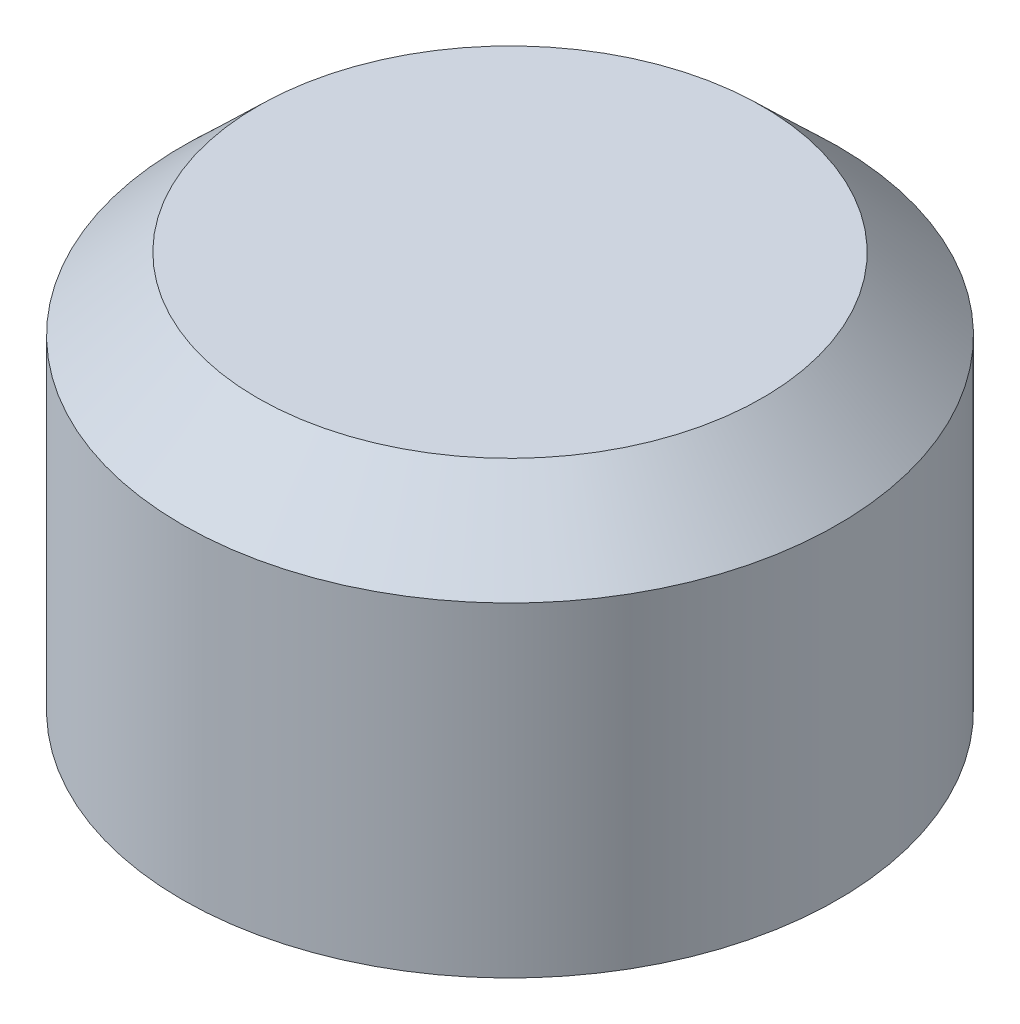
ISO-10303-21;
HEADER;
FILE_DESCRIPTION(('STEP AP214'),'2;1');
FILE_NAME('part.step','',(''),(''),'','','');
FILE_SCHEMA(('AUTOMOTIVE_DESIGN { 1 0 10303 214 1 1 1 1 }'));
ENDSEC;
DATA;
#1=APPLICATION_CONTEXT('core data for automotive mechanical design processes');
#2=APPLICATION_PROTOCOL_DEFINITION('international standard','automotive_design',2000,#1);
#3=PRODUCT_CONTEXT('',#1,'mechanical');
#4=PRODUCT('Part','Part','',(#3));
#5=PRODUCT_RELATED_PRODUCT_CATEGORY('part','',(#4));
#6=PRODUCT_DEFINITION_FORMATION('','',#4);
#7=PRODUCT_DEFINITION_CONTEXT('part definition',#1,'design');
#8=PRODUCT_DEFINITION('design','',#6,#7);
#9=PRODUCT_DEFINITION_SHAPE('','',#8);
#10=(LENGTH_UNIT() NAMED_UNIT(*) SI_UNIT(.MILLI.,.METRE.));
#11=(NAMED_UNIT(*) PLANE_ANGLE_UNIT() SI_UNIT($,.RADIAN.));
#12=(NAMED_UNIT(*) SI_UNIT($,.STERADIAN.) SOLID_ANGLE_UNIT());
#13=UNCERTAINTY_MEASURE_WITH_UNIT(LENGTH_MEASURE(1.E-05),#10,'distance_accuracy_value','');
#14=(GEOMETRIC_REPRESENTATION_CONTEXT(3) GLOBAL_UNCERTAINTY_ASSIGNED_CONTEXT((#13)) GLOBAL_UNIT_ASSIGNED_CONTEXT((#10,
#11,#12)) REPRESENTATION_CONTEXT('',''));
#15=CARTESIAN_POINT('',(0.,0.,0.));
#16=DIRECTION('',(0.,0.,1.));
#17=DIRECTION('',(1.,0.,0.));
#18=AXIS2_PLACEMENT_3D('',#15,#16,#17);
#19=CARTESIAN_POINT('',(0.,3520.44,0.));
#20=DIRECTION('',(0.,1.,0.));
#21=DIRECTION('',(0.,0.,1.));
#22=AXIS2_PLACEMENT_3D('',#19,#20,#21);
#23=CYLINDRICAL_SURFACE('',#22,2743.2);
#24=CARTESIAN_POINT('',(0.,2732.37406594724,0.));
#25=DIRECTION('',(0.,1.,0.));
#26=DIRECTION('',(0.,0.,1.));
#27=AXIS2_PLACEMENT_3D('',#24,#25,#26);
#28=CIRCLE('',#27,2743.2);
#29=CARTESIAN_POINT('',(0.,2732.37406594724,2743.2));
#30=VERTEX_POINT('',#29);
#31=EDGE_CURVE('E64',#30,#30,#28,.T.);
#32=ORIENTED_EDGE('',*,*,#31,.T.);
#33=EDGE_LOOP('',(#32));
#34=FACE_BOUND('',#33,.T.);
#35=CARTESIAN_POINT('',(0.,0.,0.));
#36=DIRECTION('',(0.,1.,0.));
#37=DIRECTION('',(0.,0.,1.));
#38=AXIS2_PLACEMENT_3D('',#35,#36,#37);
#39=CIRCLE('',#38,2743.2);
#40=CARTESIAN_POINT('',(0.,0.,2743.2));
#41=VERTEX_POINT('',#40);
#42=EDGE_CURVE('E11',#41,#41,#39,.T.);
#43=ORIENTED_EDGE('',*,*,#42,.F.);
#44=EDGE_LOOP('',(#43));
#45=FACE_BOUND('',#44,.T.);
#46=ADVANCED_FACE('F42',(#34,#45),#23,.F.);
#47=CARTESIAN_POINT('',(-2743.2,0.,0.));
#48=DIRECTION('',(0.,-1.,0.));
#49=DIRECTION('',(0.,0.,-1.));
#50=AXIS2_PLACEMENT_3D('',#47,#48,#49);
#51=PLANE('',#50);
#52=ORIENTED_EDGE('',*,*,#42,.T.);
#53=EDGE_LOOP('',(#52));
#54=FACE_BOUND('',#53,.T.);
#55=CARTESIAN_POINT('',(0.,0.,0.));
#56=DIRECTION('',(0.,1.,0.));
#57=DIRECTION('',(0.,0.,1.));
#58=AXIS2_PLACEMENT_3D('',#55,#56,#57);
#59=CIRCLE('',#58,2768.6);
#60=CARTESIAN_POINT('',(0.,0.,2768.6));
#61=VERTEX_POINT('',#60);
#62=EDGE_CURVE('E48',#61,#61,#59,.T.);
#63=ORIENTED_EDGE('',*,*,#62,.F.);
#64=EDGE_LOOP('',(#63));
#65=FACE_BOUND('',#64,.T.);
#66=ADVANCED_FACE('F82',(#54,#65),#51,.T.);
#67=CARTESIAN_POINT('',(0.,3520.44,0.));
#68=DIRECTION('',(0.,1.,0.));
#69=DIRECTION('',(0.,0.,1.));
#70=AXIS2_PLACEMENT_3D('',#67,#68,#69);
#71=CYLINDRICAL_SURFACE('',#70,2768.6);
#72=ORIENTED_EDGE('',*,*,#62,.T.);
#73=EDGE_LOOP('',(#72));
#74=FACE_BOUND('',#73,.T.);
#75=CARTESIAN_POINT('',(0.,2743.2,0.));
#76=DIRECTION('',(0.,1.,0.));
#77=DIRECTION('',(0.,0.,1.));
#78=AXIS2_PLACEMENT_3D('',#75,#76,#77);
#79=CIRCLE('',#78,2768.6);
#80=CARTESIAN_POINT('',(0.,2743.2,2768.6));
#81=VERTEX_POINT('',#80);
#82=EDGE_CURVE('E52',#81,#81,#79,.T.);
#83=ORIENTED_EDGE('',*,*,#82,.F.);
#84=EDGE_LOOP('',(#83));
#85=FACE_BOUND('',#84,.T.);
#86=ADVANCED_FACE('F86',(#74,#85),#71,.T.);
#87=CARTESIAN_POINT('',(0.,3352.8,0.));
#88=DIRECTION('',(0.,-1.,0.));
#89=DIRECTION('',(0.,0.,-1.));
#90=AXIS2_PLACEMENT_3D('',#87,#88,#89);
#91=CONICAL_SURFACE('',#90,2133.6,0.805803494083987);
#92=ORIENTED_EDGE('',*,*,#82,.T.);
#93=EDGE_LOOP('',(#92));
#94=FACE_BOUND('',#93,.T.);
#95=CARTESIAN_POINT('',(0.,3352.8,0.));
#96=DIRECTION('',(0.,1.,0.));
#97=DIRECTION('',(0.,0.,1.));
#98=AXIS2_PLACEMENT_3D('',#95,#96,#97);
#99=CIRCLE('',#98,2133.6);
#100=CARTESIAN_POINT('',(0.,3352.8,2133.6));
#101=VERTEX_POINT('',#100);
#102=EDGE_CURVE('E56',#101,#101,#99,.T.);
#103=ORIENTED_EDGE('',*,*,#102,.F.);
#104=EDGE_LOOP('',(#103));
#105=FACE_BOUND('',#104,.T.);
#106=ADVANCED_FACE('F90',(#94,#105),#91,.T.);
#107=CARTESIAN_POINT('',(0.,3352.8,0.));
#108=DIRECTION('',(0.,1.,0.));
#109=DIRECTION('',(0.,0.,1.));
#110=AXIS2_PLACEMENT_3D('',#107,#108,#109);
#111=PLANE('',#110);
#112=ORIENTED_EDGE('',*,*,#102,.T.);
#113=EDGE_LOOP('',(#112));
#114=FACE_BOUND('',#113,.T.);
#115=ADVANCED_FACE('F78',(#114),#111,.T.);
#116=CARTESIAN_POINT('',(-2123.38131869504,3327.4,0.));
#117=DIRECTION('',(0.,-1.,0.));
#118=DIRECTION('',(0.,0.,-1.));
#119=AXIS2_PLACEMENT_3D('',#116,#117,#118);
#120=PLANE('',#119);
#121=CARTESIAN_POINT('',(0.,3327.4,0.));
#122=DIRECTION('',(0.,1.,0.));
#123=DIRECTION('',(0.,0.,1.));
#124=AXIS2_PLACEMENT_3D('',#121,#122,#123);
#125=CIRCLE('',#124,2123.38131869504);
#126=CARTESIAN_POINT('',(0.,3327.4,2123.38131869504));
#127=VERTEX_POINT('',#126);
#128=EDGE_CURVE('E61',#127,#127,#125,.T.);
#129=ORIENTED_EDGE('',*,*,#128,.F.);
#130=EDGE_LOOP('',(#129));
#131=FACE_BOUND('',#130,.T.);
#132=ADVANCED_FACE('F72',(#131),#120,.T.);
#133=CARTESIAN_POINT('',(0.,2732.37406594724,0.));
#134=DIRECTION('',(0.,-1.,0.));
#135=DIRECTION('',(0.,0.,-1.));
#136=AXIS2_PLACEMENT_3D('',#133,#134,#135);
#137=CONICAL_SURFACE('',#136,2743.2,0.805803494083986);
#138=ORIENTED_EDGE('',*,*,#128,.T.);
#139=EDGE_LOOP('',(#138));
#140=FACE_BOUND('',#139,.T.);
#141=ORIENTED_EDGE('',*,*,#31,.F.);
#142=EDGE_LOOP('',(#141));
#143=FACE_BOUND('',#142,.T.);
#144=ADVANCED_FACE('F70',(#140,#143),#137,.F.);
#145=CLOSED_SHELL('',(#46,#66,#86,#106,#115,#132,#144));
#146=MANIFOLD_SOLID_BREP('B2',#145);
#147=CARTESIAN_POINT('',(-2413.,0.,0.));
#148=DIRECTION('',(0.,-1.,0.));
#149=DIRECTION('',(0.,0.,-1.));
#150=AXIS2_PLACEMENT_3D('',#147,#148,#149);
#151=PLANE('',#150);
#152=CARTESIAN_POINT('',(0.,0.,0.));
#153=DIRECTION('',(0.,1.,0.));
#154=DIRECTION('',(0.,0.,1.));
#155=AXIS2_PLACEMENT_3D('',#152,#153,#154);
#156=CIRCLE('',#155,2413.);
#157=CARTESIAN_POINT('',(0.,0.,2413.));
#158=VERTEX_POINT('',#157);
#159=EDGE_CURVE('E182',#158,#158,#156,.T.);
#160=ORIENTED_EDGE('',*,*,#159,.T.);
#161=EDGE_LOOP('',(#160));
#162=FACE_BOUND('',#161,.T.);
#163=CARTESIAN_POINT('',(0.,0.,0.));
#164=DIRECTION('',(0.,1.,0.));
#165=DIRECTION('',(0.,0.,1.));
#166=AXIS2_PLACEMENT_3D('',#163,#164,#165);
#167=CIRCLE('',#166,2438.4);
#168=CARTESIAN_POINT('',(0.,0.,2438.4));
#169=VERTEX_POINT('',#168);
#170=EDGE_CURVE('E41',#169,#169,#167,.T.);
#171=ORIENTED_EDGE('',*,*,#170,.F.);
#172=EDGE_LOOP('',(#171));
#173=FACE_BOUND('',#172,.T.);
#174=ADVANCED_FACE('F142',(#162,#173),#151,.T.);
#175=CARTESIAN_POINT('',(0.,3520.44,0.));
#176=DIRECTION('',(0.,1.,0.));
#177=DIRECTION('',(0.,0.,1.));
#178=AXIS2_PLACEMENT_3D('',#175,#176,#177);
#179=CYLINDRICAL_SURFACE('',#178,2438.4);
#180=ORIENTED_EDGE('',*,*,#170,.T.);
#181=EDGE_LOOP('',(#180));
#182=FACE_BOUND('',#181,.T.);
#183=CARTESIAN_POINT('',(0.,2753.72102448428,0.));
#184=DIRECTION('',(0.,1.,0.));
#185=DIRECTION('',(0.,0.,1.));
#186=AXIS2_PLACEMENT_3D('',#183,#184,#185);
#187=CIRCLE('',#186,2438.4);
#188=CARTESIAN_POINT('',(0.,2753.72102448428,2438.4));
#189=VERTEX_POINT('',#188);
#190=EDGE_CURVE('E148',#189,#189,#187,.T.);
#191=ORIENTED_EDGE('',*,*,#190,.F.);
#192=EDGE_LOOP('',(#191));
#193=FACE_BOUND('',#192,.T.);
#194=ADVANCED_FACE('F200',(#182,#193),#179,.T.);
#195=CARTESIAN_POINT('',(0.,3073.4,0.));
#196=DIRECTION('',(0.,-1.,0.));
#197=DIRECTION('',(0.,0.,-1.));
#198=AXIS2_PLACEMENT_3D('',#195,#196,#197);
#199=CONICAL_SURFACE('',#198,2118.72102448428,0.785398163397448);
#200=ORIENTED_EDGE('',*,*,#190,.T.);
#201=EDGE_LOOP('',(#200));
#202=FACE_BOUND('',#201,.T.);
#203=CARTESIAN_POINT('',(0.,3073.4,0.));
#204=DIRECTION('',(0.,1.,0.));
#205=DIRECTION('',(0.,0.,1.));
#206=AXIS2_PLACEMENT_3D('',#203,#204,#205);
#207=CIRCLE('',#206,2118.72102448428);
#208=CARTESIAN_POINT('',(0.,3073.4,2118.72102448428));
#209=VERTEX_POINT('',#208);
#210=EDGE_CURVE('E152',#209,#209,#207,.T.);
#211=ORIENTED_EDGE('',*,*,#210,.F.);
#212=EDGE_LOOP('',(#211));
#213=FACE_BOUND('',#212,.T.);
#214=ADVANCED_FACE('F204',(#202,#213),#199,.T.);
#215=CARTESIAN_POINT('',(-2118.72102448428,3073.4,0.));
#216=DIRECTION('',(0.,1.,0.));
#217=DIRECTION('',(0.,0.,1.));
#218=AXIS2_PLACEMENT_3D('',#215,#216,#217);
#219=PLANE('',#218);
#220=ORIENTED_EDGE('',*,*,#210,.T.);
#221=EDGE_LOOP('',(#220));
#222=FACE_BOUND('',#221,.T.);
#223=CARTESIAN_POINT('',(0.,3073.4,0.));
#224=DIRECTION('',(0.,1.,0.));
#225=DIRECTION('',(0.,0.,1.));
#226=AXIS2_PLACEMENT_3D('',#223,#224,#225);
#227=CIRCLE('',#226,1190.87720649982);
#228=CARTESIAN_POINT('',(0.,3073.4,1190.87720649982));
#229=VERTEX_POINT('',#228);
#230=EDGE_CURVE('E156',#229,#229,#227,.T.);
#231=ORIENTED_EDGE('',*,*,#230,.F.);
#232=EDGE_LOOP('',(#231));
#233=FACE_BOUND('',#232,.T.);
#234=ADVANCED_FACE('F208',(#222,#233),#219,.T.);
#235=CARTESIAN_POINT('',(0.,2796.92279350018,0.));
#236=DIRECTION('',(0.,1.,0.));
#237=DIRECTION('',(0.,0.,1.));
#238=AXIS2_PLACEMENT_3D('',#235,#236,#237);
#239=CONICAL_SURFACE('',#238,914.400000000001,0.785398163397449);
#240=ORIENTED_EDGE('',*,*,#230,.T.);
#241=EDGE_LOOP('',(#240));
#242=FACE_BOUND('',#241,.T.);
#243=CARTESIAN_POINT('',(0.,2796.92279350018,0.));
#244=DIRECTION('',(0.,1.,0.));
#245=DIRECTION('',(0.,0.,1.));
#246=AXIS2_PLACEMENT_3D('',#243,#244,#245);
#247=CIRCLE('',#246,914.400000000001);
#248=CARTESIAN_POINT('',(0.,2796.92279350018,914.400000000001));
#249=VERTEX_POINT('',#248);
#250=EDGE_CURVE('E161',#249,#249,#247,.T.);
#251=ORIENTED_EDGE('',*,*,#250,.F.);
#252=EDGE_LOOP('',(#251));
#253=FACE_BOUND('',#252,.T.);
#254=ADVANCED_FACE('F214',(#242,#253),#239,.F.);
#255=CARTESIAN_POINT('',(0.,3520.44,0.));
#256=DIRECTION('',(0.,1.,0.));
#257=DIRECTION('',(0.,0.,1.));
#258=AXIS2_PLACEMENT_3D('',#255,#256,#257);
#259=CYLINDRICAL_SURFACE('',#258,914.4);
#260=ORIENTED_EDGE('',*,*,#250,.T.);
#261=EDGE_LOOP('',(#260));
#262=FACE_BOUND('',#261,.T.);
#263=CARTESIAN_POINT('',(0.,1524.,0.));
#264=DIRECTION('',(0.,1.,0.));
#265=DIRECTION('',(0.,0.,1.));
#266=AXIS2_PLACEMENT_3D('',#263,#264,#265);
#267=CIRCLE('',#266,914.4);
#268=CARTESIAN_POINT('',(0.,1524.,914.4));
#269=VERTEX_POINT('',#268);
#270=EDGE_CURVE('E164',#269,#269,#267,.T.);
#271=ORIENTED_EDGE('',*,*,#270,.F.);
#272=EDGE_LOOP('',(#271));
#273=FACE_BOUND('',#272,.T.);
#274=ADVANCED_FACE('F218',(#262,#273),#259,.F.);
#275=CARTESIAN_POINT('',(-914.4,1524.,0.));
#276=DIRECTION('',(0.,-1.,0.));
#277=DIRECTION('',(0.,0.,-1.));
#278=AXIS2_PLACEMENT_3D('',#275,#276,#277);
#279=PLANE('',#278);
#280=ORIENTED_EDGE('',*,*,#270,.T.);
#281=EDGE_LOOP('',(#280));
#282=FACE_BOUND('',#281,.T.);
#283=CARTESIAN_POINT('',(0.,1524.,0.));
#284=DIRECTION('',(0.,1.,0.));
#285=DIRECTION('',(0.,0.,1.));
#286=AXIS2_PLACEMENT_3D('',#283,#284,#285);
#287=CIRCLE('',#286,939.8);
#288=CARTESIAN_POINT('',(0.,1524.,939.8));
#289=VERTEX_POINT('',#288);
#290=EDGE_CURVE('E167',#289,#289,#287,.T.);
#291=ORIENTED_EDGE('',*,*,#290,.F.);
#292=EDGE_LOOP('',(#291));
#293=FACE_BOUND('',#292,.T.);
#294=ADVANCED_FACE('F222',(#282,#293),#279,.T.);
#295=CARTESIAN_POINT('',(0.,3520.44,0.));
#296=DIRECTION('',(0.,1.,0.));
#297=DIRECTION('',(0.,0.,1.));
#298=AXIS2_PLACEMENT_3D('',#295,#296,#297);
#299=CYLINDRICAL_SURFACE('',#298,939.8);
#300=ORIENTED_EDGE('',*,*,#290,.T.);
#301=EDGE_LOOP('',(#300));
#302=FACE_BOUND('',#301,.T.);
#303=CARTESIAN_POINT('',(0.,2786.4017690159,0.));
#304=DIRECTION('',(0.,1.,0.));
#305=DIRECTION('',(0.,0.,1.));
#306=AXIS2_PLACEMENT_3D('',#303,#304,#305);
#307=CIRCLE('',#306,939.8);
#308=CARTESIAN_POINT('',(0.,2786.4017690159,939.8));
#309=VERTEX_POINT('',#308);
#310=EDGE_CURVE('E170',#309,#309,#307,.T.);
#311=ORIENTED_EDGE('',*,*,#310,.F.);
#312=EDGE_LOOP('',(#311));
#313=FACE_BOUND('',#312,.T.);
#314=ADVANCED_FACE('F226',(#302,#313),#299,.T.);
#315=CARTESIAN_POINT('',(0.,3048.,0.));
#316=DIRECTION('',(0.,1.,0.));
#317=DIRECTION('',(0.,0.,1.));
#318=AXIS2_PLACEMENT_3D('',#315,#316,#317);
#319=CONICAL_SURFACE('',#318,1201.3982309841,0.785398163397449);
#320=ORIENTED_EDGE('',*,*,#310,.T.);
#321=EDGE_LOOP('',(#320));
#322=FACE_BOUND('',#321,.T.);
#323=CARTESIAN_POINT('',(0.,3048.,0.));
#324=DIRECTION('',(0.,1.,0.));
#325=DIRECTION('',(0.,0.,1.));
#326=AXIS2_PLACEMENT_3D('',#323,#324,#325);
#327=CIRCLE('',#326,1201.3982309841);
#328=CARTESIAN_POINT('',(0.,3048.,1201.3982309841));
#329=VERTEX_POINT('',#328);
#330=EDGE_CURVE('E173',#329,#329,#327,.T.);
#331=ORIENTED_EDGE('',*,*,#330,.F.);
#332=EDGE_LOOP('',(#331));
#333=FACE_BOUND('',#332,.T.);
#334=ADVANCED_FACE('F230',(#322,#333),#319,.T.);
#335=CARTESIAN_POINT('',(-1201.3982309841,3048.,0.));
#336=DIRECTION('',(0.,-1.,0.));
#337=DIRECTION('',(0.,0.,-1.));
#338=AXIS2_PLACEMENT_3D('',#335,#336,#337);
#339=PLANE('',#338);
#340=ORIENTED_EDGE('',*,*,#330,.T.);
#341=EDGE_LOOP('',(#340));
#342=FACE_BOUND('',#341,.T.);
#343=CARTESIAN_POINT('',(0.,3048.,0.));
#344=DIRECTION('',(0.,1.,0.));
#345=DIRECTION('',(0.,0.,1.));
#346=AXIS2_PLACEMENT_3D('',#343,#344,#345);
#347=CIRCLE('',#346,2108.2);
#348=CARTESIAN_POINT('',(0.,3048.,2108.2));
#349=VERTEX_POINT('',#348);
#350=EDGE_CURVE('E176',#349,#349,#347,.T.);
#351=ORIENTED_EDGE('',*,*,#350,.F.);
#352=EDGE_LOOP('',(#351));
#353=FACE_BOUND('',#352,.T.);
#354=ADVANCED_FACE('F196',(#342,#353),#339,.T.);
#355=CARTESIAN_POINT('',(0.,2743.2,0.));
#356=DIRECTION('',(0.,-1.,0.));
#357=DIRECTION('',(0.,0.,-1.));
#358=AXIS2_PLACEMENT_3D('',#355,#356,#357);
#359=CONICAL_SURFACE('',#358,2413.,0.785398163397448);
#360=ORIENTED_EDGE('',*,*,#350,.T.);
#361=EDGE_LOOP('',(#360));
#362=FACE_BOUND('',#361,.T.);
#363=CARTESIAN_POINT('',(0.,2743.2,0.));
#364=DIRECTION('',(0.,1.,0.));
#365=DIRECTION('',(0.,0.,1.));
#366=AXIS2_PLACEMENT_3D('',#363,#364,#365);
#367=CIRCLE('',#366,2413.);
#368=CARTESIAN_POINT('',(0.,2743.2,2413.));
#369=VERTEX_POINT('',#368);
#370=EDGE_CURVE('E179',#369,#369,#367,.T.);
#371=ORIENTED_EDGE('',*,*,#370,.F.);
#372=EDGE_LOOP('',(#371));
#373=FACE_BOUND('',#372,.T.);
#374=ADVANCED_FACE('F190',(#362,#373),#359,.F.);
#375=CARTESIAN_POINT('',(0.,3520.44,0.));
#376=DIRECTION('',(0.,1.,0.));
#377=DIRECTION('',(0.,0.,1.));
#378=AXIS2_PLACEMENT_3D('',#375,#376,#377);
#379=CYLINDRICAL_SURFACE('',#378,2413.);
#380=ORIENTED_EDGE('',*,*,#370,.T.);
#381=EDGE_LOOP('',(#380));
#382=FACE_BOUND('',#381,.T.);
#383=ORIENTED_EDGE('',*,*,#159,.F.);
#384=EDGE_LOOP('',(#383));
#385=FACE_BOUND('',#384,.T.);
#386=ADVANCED_FACE('F188',(#382,#385),#379,.F.);
#387=CLOSED_SHELL('',(#174,#194,#214,#234,#254,#274,#294,#314,#334,#354,#374,#386));
#388=MANIFOLD_SOLID_BREP('B6',#387);
#389=ADVANCED_BREP_SHAPE_REPRESENTATION('',(#18,#146,#388),#14);
#390=SHAPE_DEFINITION_REPRESENTATION(#9,#389);
ENDSEC;
END-ISO-10303-21;
